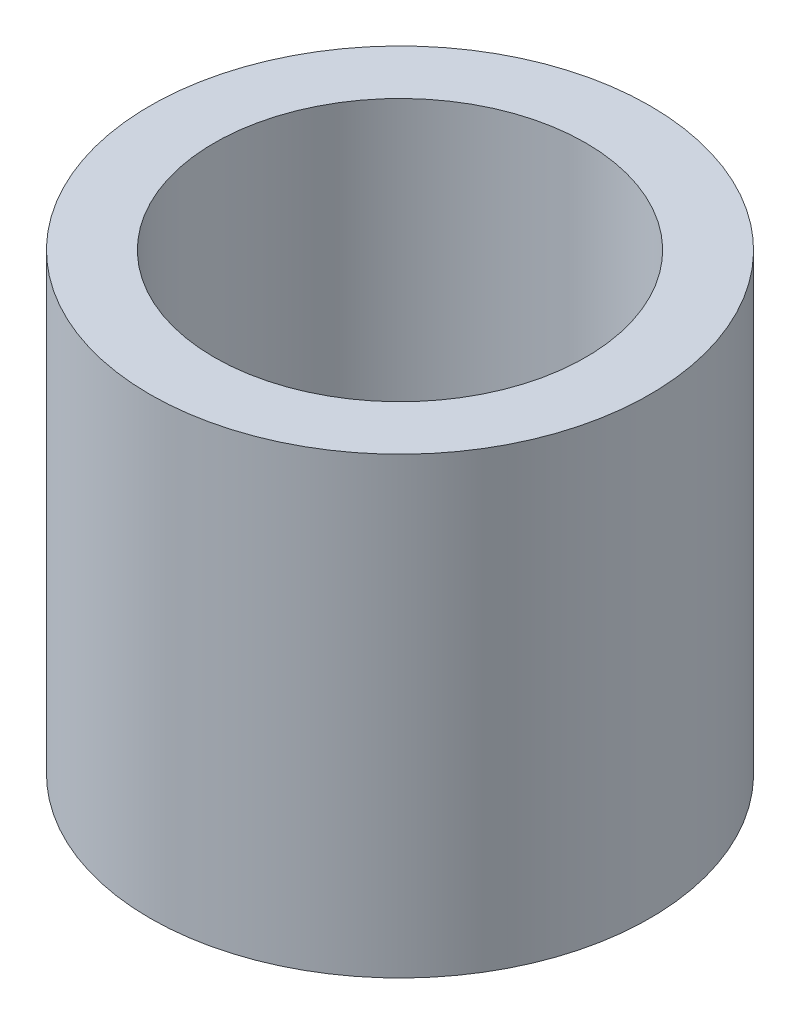
ISO-10303-21;
HEADER;
FILE_DESCRIPTION(('STEP AP214'),'2;1');
FILE_NAME('part.step','',(''),(''),'','','');
FILE_SCHEMA(('AUTOMOTIVE_DESIGN { 1 0 10303 214 1 1 1 1 }'));
ENDSEC;
DATA;
#1=APPLICATION_CONTEXT('core data for automotive mechanical design processes');
#2=APPLICATION_PROTOCOL_DEFINITION('international standard','automotive_design',2000,#1);
#3=PRODUCT_CONTEXT('',#1,'mechanical');
#4=PRODUCT('Part','Part','',(#3));
#5=PRODUCT_RELATED_PRODUCT_CATEGORY('part','',(#4));
#6=PRODUCT_DEFINITION_FORMATION('','',#4);
#7=PRODUCT_DEFINITION_CONTEXT('part definition',#1,'design');
#8=PRODUCT_DEFINITION('design','',#6,#7);
#9=PRODUCT_DEFINITION_SHAPE('','',#8);
#10=(LENGTH_UNIT() NAMED_UNIT(*) SI_UNIT(.MILLI.,.METRE.));
#11=(NAMED_UNIT(*) PLANE_ANGLE_UNIT() SI_UNIT($,.RADIAN.));
#12=(NAMED_UNIT(*) SI_UNIT($,.STERADIAN.) SOLID_ANGLE_UNIT());
#13=UNCERTAINTY_MEASURE_WITH_UNIT(LENGTH_MEASURE(1.E-05),#10,'distance_accuracy_value','');
#14=(GEOMETRIC_REPRESENTATION_CONTEXT(3) GLOBAL_UNCERTAINTY_ASSIGNED_CONTEXT((#13)) GLOBAL_UNIT_ASSIGNED_CONTEXT((#10,
#11,#12)) REPRESENTATION_CONTEXT('',''));
#15=CARTESIAN_POINT('',(0.,0.,0.));
#16=DIRECTION('',(0.,0.,1.));
#17=DIRECTION('',(1.,0.,0.));
#18=AXIS2_PLACEMENT_3D('',#15,#16,#17);
#19=CARTESIAN_POINT('',(0.,6.35,0.));
#20=DIRECTION('',(0.,1.,0.));
#21=DIRECTION('',(0.,0.,1.));
#22=AXIS2_PLACEMENT_3D('',#19,#20,#21);
#23=PLANE('',#22);
#24=CARTESIAN_POINT('',(0.,6.35,0.));
#25=DIRECTION('',(0.,1.,0.));
#26=DIRECTION('',(0.,0.,1.));
#27=AXIS2_PLACEMENT_3D('',#24,#25,#26);
#28=CIRCLE('',#27,3.5);
#29=CARTESIAN_POINT('',(0.,6.35,3.5));
#30=VERTEX_POINT('',#29);
#31=EDGE_CURVE('E10',#30,#30,#28,.T.);
#32=ORIENTED_EDGE('',*,*,#31,.T.);
#33=EDGE_LOOP('',(#32));
#34=FACE_BOUND('',#33,.T.);
#35=CARTESIAN_POINT('',(0.,6.35,0.));
#36=DIRECTION('',(0.,1.,0.));
#37=DIRECTION('',(0.,0.,1.));
#38=AXIS2_PLACEMENT_3D('',#35,#36,#37);
#39=CIRCLE('',#38,2.6);
#40=CARTESIAN_POINT('',(0.,6.35,2.6));
#41=VERTEX_POINT('',#40);
#42=EDGE_CURVE('E50',#41,#41,#39,.T.);
#43=ORIENTED_EDGE('',*,*,#42,.F.);
#44=EDGE_LOOP('',(#43));
#45=FACE_BOUND('',#44,.T.);
#46=ADVANCED_FACE('F37',(#34,#45),#23,.T.);
#47=CARTESIAN_POINT('',(0.,0.,0.));
#48=DIRECTION('',(0.,1.,0.));
#49=DIRECTION('',(0.,0.,1.));
#50=AXIS2_PLACEMENT_3D('',#47,#48,#49);
#51=PLANE('',#50);
#52=CARTESIAN_POINT('',(0.,0.,0.));
#53=DIRECTION('',(0.,1.,0.));
#54=DIRECTION('',(0.,0.,1.));
#55=AXIS2_PLACEMENT_3D('',#52,#53,#54);
#56=CIRCLE('',#55,3.5);
#57=CARTESIAN_POINT('',(0.,0.,3.5));
#58=VERTEX_POINT('',#57);
#59=EDGE_CURVE('E41',#58,#58,#56,.T.);
#60=ORIENTED_EDGE('',*,*,#59,.F.);
#61=EDGE_LOOP('',(#60));
#62=FACE_BOUND('',#61,.T.);
#63=CARTESIAN_POINT('',(0.,0.,0.));
#64=DIRECTION('',(0.,1.,0.));
#65=DIRECTION('',(0.,0.,1.));
#66=AXIS2_PLACEMENT_3D('',#63,#64,#65);
#67=CIRCLE('',#66,2.6);
#68=CARTESIAN_POINT('',(0.,0.,2.6));
#69=VERTEX_POINT('',#68);
#70=EDGE_CURVE('E52',#69,#69,#67,.T.);
#71=ORIENTED_EDGE('',*,*,#70,.T.);
#72=EDGE_LOOP('',(#71));
#73=FACE_BOUND('',#72,.T.);
#74=ADVANCED_FACE('F64',(#62,#73),#51,.F.);
#75=CARTESIAN_POINT('',(0.,6.35,0.));
#76=DIRECTION('',(0.,-1.,0.));
#77=DIRECTION('',(0.,0.,-1.));
#78=AXIS2_PLACEMENT_3D('',#75,#76,#77);
#79=CYLINDRICAL_SURFACE('',#78,3.5);
#80=ORIENTED_EDGE('',*,*,#31,.F.);
#81=EDGE_LOOP('',(#80));
#82=FACE_BOUND('',#81,.T.);
#83=ORIENTED_EDGE('',*,*,#59,.T.);
#84=EDGE_LOOP('',(#83));
#85=FACE_BOUND('',#84,.T.);
#86=ADVANCED_FACE('F39',(#82,#85),#79,.T.);
#87=CARTESIAN_POINT('',(0.,6.35,0.));
#88=DIRECTION('',(0.,-1.,0.));
#89=DIRECTION('',(0.,0.,-1.));
#90=AXIS2_PLACEMENT_3D('',#87,#88,#89);
#91=CYLINDRICAL_SURFACE('',#90,2.6);
#92=ORIENTED_EDGE('',*,*,#42,.T.);
#93=EDGE_LOOP('',(#92));
#94=FACE_BOUND('',#93,.T.);
#95=ORIENTED_EDGE('',*,*,#70,.F.);
#96=EDGE_LOOP('',(#95));
#97=FACE_BOUND('',#96,.T.);
#98=ADVANCED_FACE('F60',(#94,#97),#91,.F.);
#99=CLOSED_SHELL('',(#46,#74,#86,#98));
#100=MANIFOLD_SOLID_BREP('B2',#99);
#101=ADVANCED_BREP_SHAPE_REPRESENTATION('',(#18,#100),#14);
#102=SHAPE_DEFINITION_REPRESENTATION(#9,#101);
ENDSEC;
END-ISO-10303-21;
